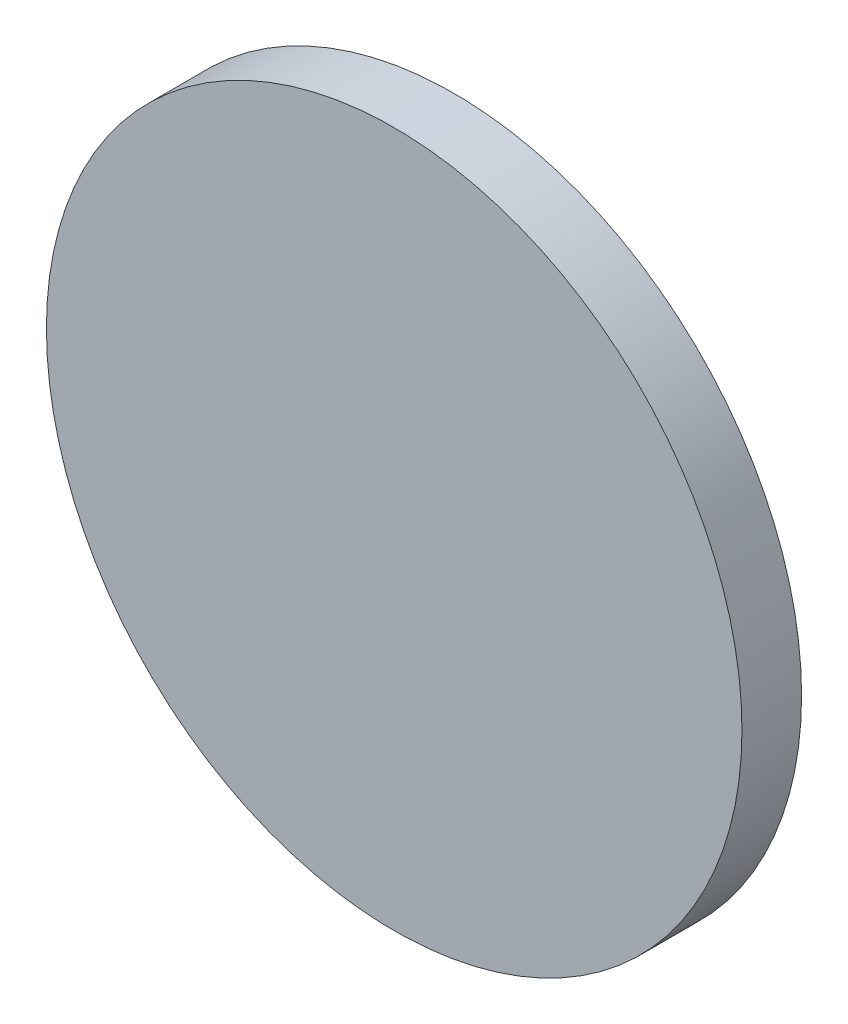
ISO-10303-21;
HEADER;
FILE_DESCRIPTION(('STEP AP214'),'2;1');
FILE_NAME('part.step','',(''),(''),'','','');
FILE_SCHEMA(('AUTOMOTIVE_DESIGN { 1 0 10303 214 1 1 1 1 }'));
ENDSEC;
DATA;
#1=APPLICATION_CONTEXT('core data for automotive mechanical design processes');
#2=APPLICATION_PROTOCOL_DEFINITION('international standard','automotive_design',2000,#1);
#3=PRODUCT_CONTEXT('',#1,'mechanical');
#4=PRODUCT('Part','Part','',(#3));
#5=PRODUCT_RELATED_PRODUCT_CATEGORY('part','',(#4));
#6=PRODUCT_DEFINITION_FORMATION('','',#4);
#7=PRODUCT_DEFINITION_CONTEXT('part definition',#1,'design');
#8=PRODUCT_DEFINITION('design','',#6,#7);
#9=PRODUCT_DEFINITION_SHAPE('','',#8);
#10=(LENGTH_UNIT() NAMED_UNIT(*) SI_UNIT(.MILLI.,.METRE.));
#11=(NAMED_UNIT(*) PLANE_ANGLE_UNIT() SI_UNIT($,.RADIAN.));
#12=(NAMED_UNIT(*) SI_UNIT($,.STERADIAN.) SOLID_ANGLE_UNIT());
#13=UNCERTAINTY_MEASURE_WITH_UNIT(LENGTH_MEASURE(1.E-05),#10,'distance_accuracy_value','');
#14=(GEOMETRIC_REPRESENTATION_CONTEXT(3) GLOBAL_UNCERTAINTY_ASSIGNED_CONTEXT((#13)) GLOBAL_UNIT_ASSIGNED_CONTEXT((#10,
#11,#12)) REPRESENTATION_CONTEXT('',''));
#15=CARTESIAN_POINT('',(0.,0.,0.));
#16=DIRECTION('',(0.,0.,1.));
#17=DIRECTION('',(1.,0.,0.));
#18=AXIS2_PLACEMENT_3D('',#15,#16,#17);
#19=CARTESIAN_POINT('',(2.6797,7.599680006176,0.));
#20=DIRECTION('',(0.,0.,-1.));
#21=DIRECTION('',(-1.,0.,0.));
#22=AXIS2_PLACEMENT_3D('',#19,#20,#21);
#23=PLANE('',#22);
#24=CARTESIAN_POINT('',(2.6797,7.599680006176,0.));
#25=DIRECTION('',(0.,0.,1.));
#26=DIRECTION('',(1.,0.,0.));
#27=AXIS2_PLACEMENT_3D('',#24,#25,#26);
#28=CIRCLE('',#27,0.200024667);
#29=CARTESIAN_POINT('',(2.879724667,7.599680006176,0.));
#30=VERTEX_POINT('',#29);
#31=EDGE_CURVE('E18',#30,#30,#28,.T.);
#32=ORIENTED_EDGE('',*,*,#31,.F.);
#33=EDGE_LOOP('',(#32));
#34=FACE_BOUND('',#33,.T.);
#35=ADVANCED_FACE('F15',(#34),#23,.T.);
#36=CARTESIAN_POINT('',(2.6797,7.599680006176,0.));
#37=DIRECTION('',(0.,0.,1.));
#38=DIRECTION('',(1.,0.,0.));
#39=AXIS2_PLACEMENT_3D('',#36,#37,#38);
#40=CYLINDRICAL_SURFACE('',#39,0.200024667);
#41=CARTESIAN_POINT('',(2.6797,7.599680006176,0.03429));
#42=DIRECTION('',(0.,0.,1.));
#43=DIRECTION('',(1.,0.,0.));
#44=AXIS2_PLACEMENT_3D('',#41,#42,#43);
#45=CIRCLE('',#44,0.200024667);
#46=CARTESIAN_POINT('',(2.879724667,7.599680006176,0.03429));
#47=VERTEX_POINT('',#46);
#48=EDGE_CURVE('E10',#47,#47,#45,.T.);
#49=ORIENTED_EDGE('',*,*,#48,.F.);
#50=EDGE_LOOP('',(#49));
#51=FACE_BOUND('',#50,.T.);
#52=ORIENTED_EDGE('',*,*,#31,.T.);
#53=EDGE_LOOP('',(#52));
#54=FACE_BOUND('',#53,.T.);
#55=ADVANCED_FACE('F27',(#51,#54),#40,.T.);
#56=CARTESIAN_POINT('',(2.6797,7.599680006176,0.03429));
#57=DIRECTION('',(0.,0.,1.));
#58=DIRECTION('',(1.,0.,0.));
#59=AXIS2_PLACEMENT_3D('',#56,#57,#58);
#60=PLANE('',#59);
#61=ORIENTED_EDGE('',*,*,#48,.T.);
#62=EDGE_LOOP('',(#61));
#63=FACE_BOUND('',#62,.T.);
#64=ADVANCED_FACE('F34',(#63),#60,.T.);
#65=CLOSED_SHELL('',(#35,#55,#64));
#66=MANIFOLD_SOLID_BREP('B1',#65);
#67=ADVANCED_BREP_SHAPE_REPRESENTATION('',(#18,#66),#14);
#68=SHAPE_DEFINITION_REPRESENTATION(#9,#67);
ENDSEC;
END-ISO-10303-21;
